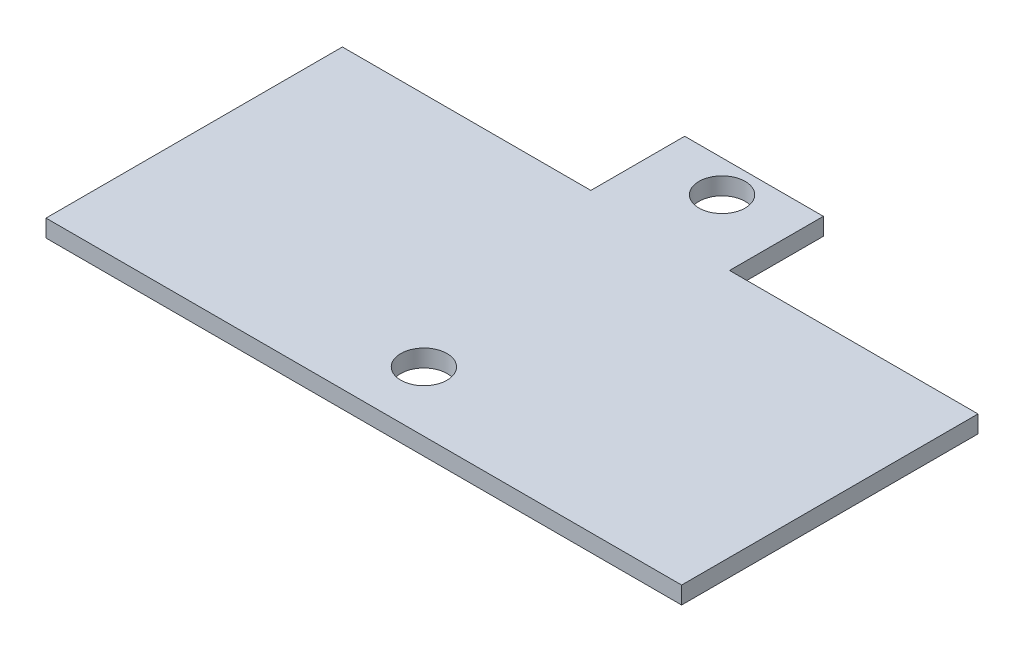
ISO-10303-21;
HEADER;
FILE_DESCRIPTION(('STEP AP214'),'2;1');
FILE_NAME('part.step','',(''),(''),'','','');
FILE_SCHEMA(('AUTOMOTIVE_DESIGN { 1 0 10303 214 1 1 1 1 }'));
ENDSEC;
DATA;
#1=APPLICATION_CONTEXT('core data for automotive mechanical design processes');
#2=APPLICATION_PROTOCOL_DEFINITION('international standard','automotive_design',2000,#1);
#3=PRODUCT_CONTEXT('',#1,'mechanical');
#4=PRODUCT('Part','Part','',(#3));
#5=PRODUCT_RELATED_PRODUCT_CATEGORY('part','',(#4));
#6=PRODUCT_DEFINITION_FORMATION('','',#4);
#7=PRODUCT_DEFINITION_CONTEXT('part definition',#1,'design');
#8=PRODUCT_DEFINITION('design','',#6,#7);
#9=PRODUCT_DEFINITION_SHAPE('','',#8);
#10=(LENGTH_UNIT() NAMED_UNIT(*) SI_UNIT(.MILLI.,.METRE.));
#11=(NAMED_UNIT(*) PLANE_ANGLE_UNIT() SI_UNIT($,.RADIAN.));
#12=(NAMED_UNIT(*) SI_UNIT($,.STERADIAN.) SOLID_ANGLE_UNIT());
#13=UNCERTAINTY_MEASURE_WITH_UNIT(LENGTH_MEASURE(1.E-05),#10,'distance_accuracy_value','');
#14=(GEOMETRIC_REPRESENTATION_CONTEXT(3) GLOBAL_UNCERTAINTY_ASSIGNED_CONTEXT((#13)) GLOBAL_UNIT_ASSIGNED_CONTEXT((#10,
#11,#12)) REPRESENTATION_CONTEXT('',''));
#15=CARTESIAN_POINT('',(0.,0.,0.));
#16=DIRECTION('',(0.,0.,1.));
#17=DIRECTION('',(1.,0.,0.));
#18=AXIS2_PLACEMENT_3D('',#15,#16,#17);
#19=CARTESIAN_POINT('',(0.,1.5,0.));
#20=DIRECTION('',(0.,-1.,0.));
#21=DIRECTION('',(0.,0.,-1.));
#22=AXIS2_PLACEMENT_3D('',#19,#20,#21);
#23=PLANE('',#22);
#24=DIRECTION('',(0.,0.,1.));
#25=VECTOR('',#24,1.);
#26=CARTESIAN_POINT('',(0.,1.5,0.));
#27=LINE('',#26,#25);
#28=CARTESIAN_POINT('',(0.,1.5,-25.6464684047065));
#29=VERTEX_POINT('',#28);
#30=CARTESIAN_POINT('',(0.,1.5,0.));
#31=VERTEX_POINT('',#30);
#32=EDGE_CURVE('E145',#29,#31,#27,.T.);
#33=ORIENTED_EDGE('',*,*,#32,.T.);
#34=DIRECTION('',(1.,0.,0.));
#35=VECTOR('',#34,1.);
#36=CARTESIAN_POINT('',(0.,1.5,0.));
#37=LINE('',#36,#35);
#38=CARTESIAN_POINT('',(55.,1.5,0.));
#39=VERTEX_POINT('',#38);
#40=EDGE_CURVE('E93',#31,#39,#37,.T.);
#41=ORIENTED_EDGE('',*,*,#40,.T.);
#42=DIRECTION('',(0.,0.,-1.));
#43=VECTOR('',#42,1.);
#44=CARTESIAN_POINT('',(55.,1.5,0.));
#45=LINE('',#44,#43);
#46=CARTESIAN_POINT('',(55.,1.5,-25.6464684047065));
#47=VERTEX_POINT('',#46);
#48=EDGE_CURVE('E160',#39,#47,#45,.T.);
#49=ORIENTED_EDGE('',*,*,#48,.T.);
#50=DIRECTION('',(-1.,0.,0.));
#51=VECTOR('',#50,1.);
#52=CARTESIAN_POINT('',(33.5,1.5,-25.6464684047065));
#53=LINE('',#52,#51);
#54=CARTESIAN_POINT('',(33.5,1.5,-25.6464684047065));
#55=VERTEX_POINT('',#54);
#56=EDGE_CURVE('E173',#47,#55,#53,.T.);
#57=ORIENTED_EDGE('',*,*,#56,.T.);
#58=DIRECTION('',(0.,0.,-1.));
#59=VECTOR('',#58,1.);
#60=CARTESIAN_POINT('',(33.5,1.5,-33.7649124070522));
#61=LINE('',#60,#59);
#62=CARTESIAN_POINT('',(33.5,1.5,-33.7649124070522));
#63=VERTEX_POINT('',#62);
#64=EDGE_CURVE('E112',#55,#63,#61,.T.);
#65=ORIENTED_EDGE('',*,*,#64,.T.);
#66=DIRECTION('',(-1.,0.,0.));
#67=VECTOR('',#66,1.);
#68=CARTESIAN_POINT('',(21.5,1.5,-33.7649124070522));
#69=LINE('',#68,#67);
#70=CARTESIAN_POINT('',(21.5,1.5,-33.7649124070522));
#71=VERTEX_POINT('',#70);
#72=EDGE_CURVE('E106',#63,#71,#69,.T.);
#73=ORIENTED_EDGE('',*,*,#72,.T.);
#74=DIRECTION('',(0.,0.,1.));
#75=VECTOR('',#74,1.);
#76=CARTESIAN_POINT('',(21.5,1.5,-25.6464684047065));
#77=LINE('',#76,#75);
#78=CARTESIAN_POINT('',(21.5,1.5,-25.6464684047065));
#79=VERTEX_POINT('',#78);
#80=EDGE_CURVE('E110',#71,#79,#77,.T.);
#81=ORIENTED_EDGE('',*,*,#80,.T.);
#82=DIRECTION('',(-1.,0.,0.));
#83=VECTOR('',#82,1.);
#84=CARTESIAN_POINT('',(0.,1.5,-25.6464684047065));
#85=LINE('',#84,#83);
#86=EDGE_CURVE('E50',#79,#29,#85,.T.);
#87=ORIENTED_EDGE('',*,*,#86,.T.);
#88=EDGE_LOOP('',(#33,#41,#49,#57,#65,#73,#81,#87));
#89=FACE_BOUND('',#88,.T.);
#90=CARTESIAN_POINT('',(27.5,1.5,-31.));
#91=DIRECTION('',(0.,1.,0.));
#92=DIRECTION('',(0.,0.,-1.));
#93=AXIS2_PLACEMENT_3D('',#90,#91,#92);
#94=CIRCLE('',#93,2.00000000000001);
#95=CARTESIAN_POINT('',(27.5,1.5,-33.));
#96=VERTEX_POINT('',#95);
#97=EDGE_CURVE('E134',#96,#96,#94,.T.);
#98=ORIENTED_EDGE('',*,*,#97,.F.);
#99=EDGE_LOOP('',(#98));
#100=FACE_BOUND('',#99,.T.);
#101=CARTESIAN_POINT('',(27.5,1.5,-5.2));
#102=DIRECTION('',(0.,1.,0.));
#103=DIRECTION('',(0.,0.,-1.));
#104=AXIS2_PLACEMENT_3D('',#101,#102,#103);
#105=CIRCLE('',#104,2.00000000000001);
#106=CARTESIAN_POINT('',(27.5,1.5,-7.20000000000001));
#107=VERTEX_POINT('',#106);
#108=EDGE_CURVE('E182',#107,#107,#105,.T.);
#109=ORIENTED_EDGE('',*,*,#108,.F.);
#110=EDGE_LOOP('',(#109));
#111=FACE_BOUND('',#110,.T.);
#112=ADVANCED_FACE('F33',(#89,#100,#111),#23,.F.);
#113=CARTESIAN_POINT('',(0.,0.,0.));
#114=DIRECTION('',(0.,-1.,0.));
#115=DIRECTION('',(0.,0.,-1.));
#116=AXIS2_PLACEMENT_3D('',#113,#114,#115);
#117=PLANE('',#116);
#118=CARTESIAN_POINT('',(27.5,0.,-31.));
#119=DIRECTION('',(0.,1.,0.));
#120=DIRECTION('',(0.,0.,-1.));
#121=AXIS2_PLACEMENT_3D('',#118,#119,#120);
#122=CIRCLE('',#121,2.00000000000001);
#123=CARTESIAN_POINT('',(27.5,0.,-33.));
#124=VERTEX_POINT('',#123);
#125=EDGE_CURVE('E179',#124,#124,#122,.T.);
#126=ORIENTED_EDGE('',*,*,#125,.T.);
#127=EDGE_LOOP('',(#126));
#128=FACE_BOUND('',#127,.T.);
#129=DIRECTION('',(0.,0.,1.));
#130=VECTOR('',#129,1.);
#131=CARTESIAN_POINT('',(0.,0.,0.));
#132=LINE('',#131,#130);
#133=CARTESIAN_POINT('',(0.,0.,-25.6464684047065));
#134=VERTEX_POINT('',#133);
#135=CARTESIAN_POINT('',(0.,0.,0.));
#136=VERTEX_POINT('',#135);
#137=EDGE_CURVE('E130',#134,#136,#132,.T.);
#138=ORIENTED_EDGE('',*,*,#137,.F.);
#139=DIRECTION('',(-1.,0.,0.));
#140=VECTOR('',#139,1.);
#141=CARTESIAN_POINT('',(0.,0.,-25.6464684047065));
#142=LINE('',#141,#140);
#143=CARTESIAN_POINT('',(21.5,0.,-25.6464684047065));
#144=VERTEX_POINT('',#143);
#145=EDGE_CURVE('E85',#144,#134,#142,.T.);
#146=ORIENTED_EDGE('',*,*,#145,.F.);
#147=DIRECTION('',(0.,0.,1.));
#148=VECTOR('',#147,1.);
#149=CARTESIAN_POINT('',(21.5,0.,-25.6464684047065));
#150=LINE('',#149,#148);
#151=CARTESIAN_POINT('',(21.5,0.,-33.7649124070522));
#152=VERTEX_POINT('',#151);
#153=EDGE_CURVE('E79',#152,#144,#150,.T.);
#154=ORIENTED_EDGE('',*,*,#153,.F.);
#155=DIRECTION('',(-1.,0.,0.));
#156=VECTOR('',#155,1.);
#157=CARTESIAN_POINT('',(21.5,0.,-33.7649124070522));
#158=LINE('',#157,#156);
#159=CARTESIAN_POINT('',(33.5,0.,-33.7649124070522));
#160=VERTEX_POINT('',#159);
#161=EDGE_CURVE('E120',#160,#152,#158,.T.);
#162=ORIENTED_EDGE('',*,*,#161,.F.);
#163=DIRECTION('',(0.,0.,-1.));
#164=VECTOR('',#163,1.);
#165=CARTESIAN_POINT('',(33.5,0.,-33.7649124070522));
#166=LINE('',#165,#164);
#167=CARTESIAN_POINT('',(33.5,0.,-25.6464684047065));
#168=VERTEX_POINT('',#167);
#169=EDGE_CURVE('E140',#168,#160,#166,.T.);
#170=ORIENTED_EDGE('',*,*,#169,.F.);
#171=DIRECTION('',(-1.,0.,0.));
#172=VECTOR('',#171,1.);
#173=CARTESIAN_POINT('',(33.5,0.,-25.6464684047065));
#174=LINE('',#173,#172);
#175=CARTESIAN_POINT('',(55.,0.,-25.6464684047065));
#176=VERTEX_POINT('',#175);
#177=EDGE_CURVE('E138',#176,#168,#174,.T.);
#178=ORIENTED_EDGE('',*,*,#177,.F.);
#179=DIRECTION('',(0.,0.,-1.));
#180=VECTOR('',#179,1.);
#181=CARTESIAN_POINT('',(55.,0.,0.));
#182=LINE('',#181,#180);
#183=CARTESIAN_POINT('',(55.,0.,0.));
#184=VERTEX_POINT('',#183);
#185=EDGE_CURVE('E136',#184,#176,#182,.T.);
#186=ORIENTED_EDGE('',*,*,#185,.F.);
#187=DIRECTION('',(1.,0.,0.));
#188=VECTOR('',#187,1.);
#189=CARTESIAN_POINT('',(0.,0.,0.));
#190=LINE('',#189,#188);
#191=EDGE_CURVE('E133',#136,#184,#190,.T.);
#192=ORIENTED_EDGE('',*,*,#191,.F.);
#193=EDGE_LOOP('',(#138,#146,#154,#162,#170,#178,#186,#192));
#194=FACE_BOUND('',#193,.T.);
#195=CARTESIAN_POINT('',(27.5,0.,-5.2));
#196=DIRECTION('',(0.,1.,0.));
#197=DIRECTION('',(0.,0.,-1.));
#198=AXIS2_PLACEMENT_3D('',#195,#196,#197);
#199=CIRCLE('',#198,2.00000000000001);
#200=CARTESIAN_POINT('',(27.5,0.,-7.20000000000001));
#201=VERTEX_POINT('',#200);
#202=EDGE_CURVE('E185',#201,#201,#199,.T.);
#203=ORIENTED_EDGE('',*,*,#202,.T.);
#204=EDGE_LOOP('',(#203));
#205=FACE_BOUND('',#204,.T.);
#206=ADVANCED_FACE('F164',(#128,#194,#205),#117,.T.);
#207=CARTESIAN_POINT('',(0.,1.5,0.));
#208=DIRECTION('',(1.,0.,0.));
#209=DIRECTION('',(0.,0.,-1.));
#210=AXIS2_PLACEMENT_3D('',#207,#208,#209);
#211=PLANE('',#210);
#212=ORIENTED_EDGE('',*,*,#137,.T.);
#213=DIRECTION('',(0.,-1.,0.));
#214=VECTOR('',#213,1.);
#215=CARTESIAN_POINT('',(0.,1.5,0.));
#216=LINE('',#215,#214);
#217=EDGE_CURVE('E11',#31,#136,#216,.T.);
#218=ORIENTED_EDGE('',*,*,#217,.F.);
#219=ORIENTED_EDGE('',*,*,#32,.F.);
#220=DIRECTION('',(0.,-1.,0.));
#221=VECTOR('',#220,1.);
#222=CARTESIAN_POINT('',(0.,1.5,-25.6464684047065));
#223=LINE('',#222,#221);
#224=EDGE_CURVE('E126',#29,#134,#223,.T.);
#225=ORIENTED_EDGE('',*,*,#224,.T.);
#226=EDGE_LOOP('',(#212,#218,#219,#225));
#227=FACE_BOUND('',#226,.T.);
#228=ADVANCED_FACE('F35',(#227),#211,.F.);
#229=CARTESIAN_POINT('',(0.,1.5,0.));
#230=DIRECTION('',(0.,0.,-1.));
#231=DIRECTION('',(-1.,0.,0.));
#232=AXIS2_PLACEMENT_3D('',#229,#230,#231);
#233=PLANE('',#232);
#234=ORIENTED_EDGE('',*,*,#191,.T.);
#235=DIRECTION('',(0.,-1.,0.));
#236=VECTOR('',#235,1.);
#237=CARTESIAN_POINT('',(55.,1.5,0.));
#238=LINE('',#237,#236);
#239=EDGE_CURVE('E42',#39,#184,#238,.T.);
#240=ORIENTED_EDGE('',*,*,#239,.F.);
#241=ORIENTED_EDGE('',*,*,#40,.F.);
#242=ORIENTED_EDGE('',*,*,#217,.T.);
#243=EDGE_LOOP('',(#234,#240,#241,#242));
#244=FACE_BOUND('',#243,.T.);
#245=ADVANCED_FACE('F217',(#244),#233,.F.);
#246=CARTESIAN_POINT('',(55.,1.5,0.));
#247=DIRECTION('',(-1.,0.,0.));
#248=DIRECTION('',(0.,0.,1.));
#249=AXIS2_PLACEMENT_3D('',#246,#247,#248);
#250=PLANE('',#249);
#251=ORIENTED_EDGE('',*,*,#185,.T.);
#252=DIRECTION('',(0.,-1.,0.));
#253=VECTOR('',#252,1.);
#254=CARTESIAN_POINT('',(55.,1.5,-25.6464684047065));
#255=LINE('',#254,#253);
#256=EDGE_CURVE('E152',#47,#176,#255,.T.);
#257=ORIENTED_EDGE('',*,*,#256,.F.);
#258=ORIENTED_EDGE('',*,*,#48,.F.);
#259=ORIENTED_EDGE('',*,*,#239,.T.);
#260=EDGE_LOOP('',(#251,#257,#258,#259));
#261=FACE_BOUND('',#260,.T.);
#262=ADVANCED_FACE('F158',(#261),#250,.F.);
#263=CARTESIAN_POINT('',(33.5,1.5,-25.6464684047065));
#264=DIRECTION('',(0.,0.,1.));
#265=DIRECTION('',(1.,0.,0.));
#266=AXIS2_PLACEMENT_3D('',#263,#264,#265);
#267=PLANE('',#266);
#268=ORIENTED_EDGE('',*,*,#177,.T.);
#269=DIRECTION('',(0.,-1.,0.));
#270=VECTOR('',#269,1.);
#271=CARTESIAN_POINT('',(33.5,1.5,-25.6464684047065));
#272=LINE('',#271,#270);
#273=EDGE_CURVE('E149',#55,#168,#272,.T.);
#274=ORIENTED_EDGE('',*,*,#273,.F.);
#275=ORIENTED_EDGE('',*,*,#56,.F.);
#276=ORIENTED_EDGE('',*,*,#256,.T.);
#277=EDGE_LOOP('',(#268,#274,#275,#276));
#278=FACE_BOUND('',#277,.T.);
#279=ADVANCED_FACE('F169',(#278),#267,.F.);
#280=CARTESIAN_POINT('',(33.5,1.5,-33.7649124070522));
#281=DIRECTION('',(-1.,0.,0.));
#282=DIRECTION('',(0.,0.,1.));
#283=AXIS2_PLACEMENT_3D('',#280,#281,#282);
#284=PLANE('',#283);
#285=ORIENTED_EDGE('',*,*,#169,.T.);
#286=DIRECTION('',(0.,-1.,0.));
#287=VECTOR('',#286,1.);
#288=CARTESIAN_POINT('',(33.5,1.5,-33.7649124070522));
#289=LINE('',#288,#287);
#290=EDGE_CURVE('E121',#63,#160,#289,.T.);
#291=ORIENTED_EDGE('',*,*,#290,.F.);
#292=ORIENTED_EDGE('',*,*,#64,.F.);
#293=ORIENTED_EDGE('',*,*,#273,.T.);
#294=EDGE_LOOP('',(#285,#291,#292,#293));
#295=FACE_BOUND('',#294,.T.);
#296=ADVANCED_FACE('F172',(#295),#284,.F.);
#297=CARTESIAN_POINT('',(21.5,1.5,-33.7649124070522));
#298=DIRECTION('',(0.,0.,1.));
#299=DIRECTION('',(1.,0.,0.));
#300=AXIS2_PLACEMENT_3D('',#297,#298,#299);
#301=PLANE('',#300);
#302=ORIENTED_EDGE('',*,*,#161,.T.);
#303=DIRECTION('',(0.,-1.,0.));
#304=VECTOR('',#303,1.);
#305=CARTESIAN_POINT('',(21.5,1.5,-33.7649124070522));
#306=LINE('',#305,#304);
#307=EDGE_CURVE('E117',#71,#152,#306,.T.);
#308=ORIENTED_EDGE('',*,*,#307,.F.);
#309=ORIENTED_EDGE('',*,*,#72,.F.);
#310=ORIENTED_EDGE('',*,*,#290,.T.);
#311=EDGE_LOOP('',(#302,#308,#309,#310));
#312=FACE_BOUND('',#311,.T.);
#313=ADVANCED_FACE('F118',(#312),#301,.F.);
#314=CARTESIAN_POINT('',(21.5,1.5,-25.6464684047065));
#315=DIRECTION('',(1.,0.,0.));
#316=DIRECTION('',(0.,0.,-1.));
#317=AXIS2_PLACEMENT_3D('',#314,#315,#316);
#318=PLANE('',#317);
#319=ORIENTED_EDGE('',*,*,#153,.T.);
#320=DIRECTION('',(0.,-1.,0.));
#321=VECTOR('',#320,1.);
#322=CARTESIAN_POINT('',(21.5,1.5,-25.6464684047065));
#323=LINE('',#322,#321);
#324=EDGE_CURVE('E122',#79,#144,#323,.T.);
#325=ORIENTED_EDGE('',*,*,#324,.F.);
#326=ORIENTED_EDGE('',*,*,#80,.F.);
#327=ORIENTED_EDGE('',*,*,#307,.T.);
#328=EDGE_LOOP('',(#319,#325,#326,#327));
#329=FACE_BOUND('',#328,.T.);
#330=ADVANCED_FACE('F124',(#329),#318,.F.);
#331=CARTESIAN_POINT('',(0.,1.5,-25.6464684047065));
#332=DIRECTION('',(0.,0.,1.));
#333=DIRECTION('',(1.,0.,0.));
#334=AXIS2_PLACEMENT_3D('',#331,#332,#333);
#335=PLANE('',#334);
#336=ORIENTED_EDGE('',*,*,#145,.T.);
#337=ORIENTED_EDGE('',*,*,#224,.F.);
#338=ORIENTED_EDGE('',*,*,#86,.F.);
#339=ORIENTED_EDGE('',*,*,#324,.T.);
#340=EDGE_LOOP('',(#336,#337,#338,#339));
#341=FACE_BOUND('',#340,.T.);
#342=ADVANCED_FACE('F205',(#341),#335,.F.);
#343=CARTESIAN_POINT('',(27.5,1.5,-31.));
#344=DIRECTION('',(0.,-1.,0.));
#345=DIRECTION('',(0.,0.,-1.));
#346=AXIS2_PLACEMENT_3D('',#343,#344,#345);
#347=CYLINDRICAL_SURFACE('',#346,2.00000000000001);
#348=ORIENTED_EDGE('',*,*,#97,.T.);
#349=EDGE_LOOP('',(#348));
#350=FACE_BOUND('',#349,.T.);
#351=ORIENTED_EDGE('',*,*,#125,.F.);
#352=EDGE_LOOP('',(#351));
#353=FACE_BOUND('',#352,.T.);
#354=ADVANCED_FACE('F202',(#350,#353),#347,.F.);
#355=CARTESIAN_POINT('',(27.5,1.5,-5.2));
#356=DIRECTION('',(0.,-1.,0.));
#357=DIRECTION('',(0.,0.,-1.));
#358=AXIS2_PLACEMENT_3D('',#355,#356,#357);
#359=CYLINDRICAL_SURFACE('',#358,2.00000000000001);
#360=ORIENTED_EDGE('',*,*,#108,.T.);
#361=EDGE_LOOP('',(#360));
#362=FACE_BOUND('',#361,.T.);
#363=ORIENTED_EDGE('',*,*,#202,.F.);
#364=EDGE_LOOP('',(#363));
#365=FACE_BOUND('',#364,.T.);
#366=ADVANCED_FACE('F191',(#362,#365),#359,.F.);
#367=CLOSED_SHELL('',(#112,#206,#228,#245,#262,#279,#296,#313,#330,#342,#354,#366));
#368=MANIFOLD_SOLID_BREP('B2',#367);
#369=ADVANCED_BREP_SHAPE_REPRESENTATION('',(#18,#368),#14);
#370=SHAPE_DEFINITION_REPRESENTATION(#9,#369);
ENDSEC;
END-ISO-10303-21;
